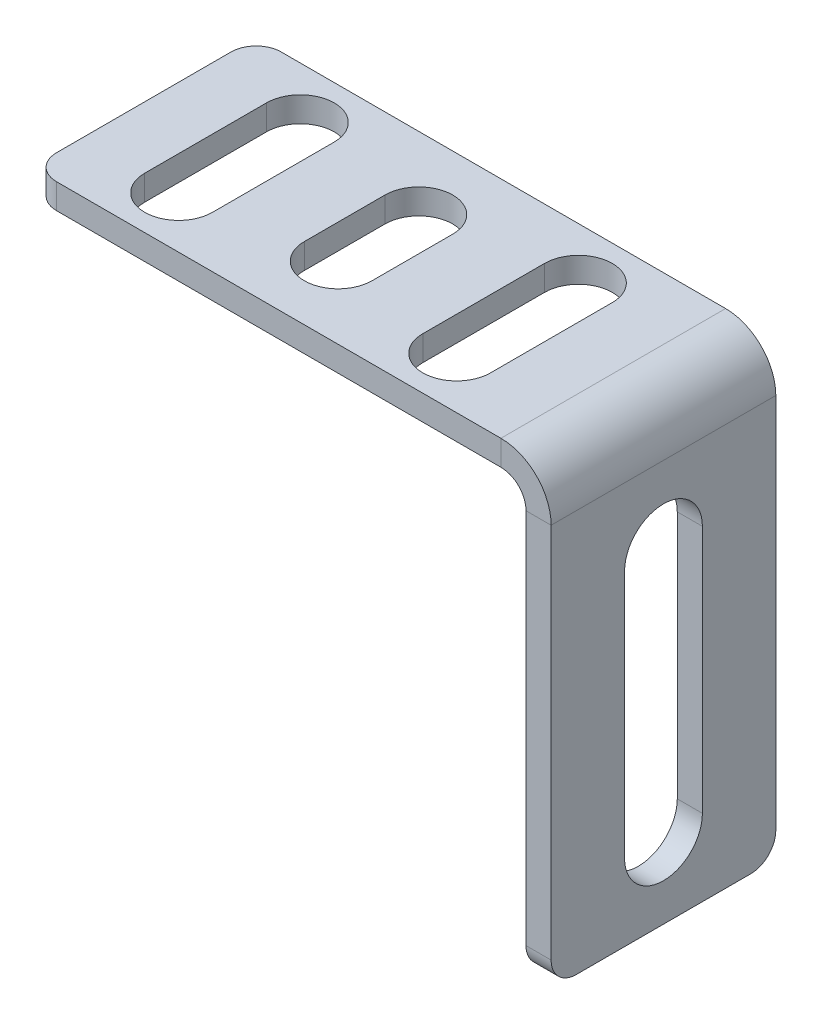
ISO-10303-21;
HEADER;
FILE_DESCRIPTION(('STEP AP214'),'2;1');
FILE_NAME('part.step','',(''),(''),'','','');
FILE_SCHEMA(('AUTOMOTIVE_DESIGN { 1 0 10303 214 1 1 1 1 }'));
ENDSEC;
DATA;
#1=APPLICATION_CONTEXT('core data for automotive mechanical design processes');
#2=APPLICATION_PROTOCOL_DEFINITION('international standard','automotive_design',2000,#1);
#3=PRODUCT_CONTEXT('',#1,'mechanical');
#4=PRODUCT('Part','Part','',(#3));
#5=PRODUCT_RELATED_PRODUCT_CATEGORY('part','',(#4));
#6=PRODUCT_DEFINITION_FORMATION('','',#4);
#7=PRODUCT_DEFINITION_CONTEXT('part definition',#1,'design');
#8=PRODUCT_DEFINITION('design','',#6,#7);
#9=PRODUCT_DEFINITION_SHAPE('','',#8);
#10=(LENGTH_UNIT() NAMED_UNIT(*) SI_UNIT(.MILLI.,.METRE.));
#11=(NAMED_UNIT(*) PLANE_ANGLE_UNIT() SI_UNIT($,.RADIAN.));
#12=(NAMED_UNIT(*) SI_UNIT($,.STERADIAN.) SOLID_ANGLE_UNIT());
#13=UNCERTAINTY_MEASURE_WITH_UNIT(LENGTH_MEASURE(1.E-05),#10,'distance_accuracy_value','');
#14=(GEOMETRIC_REPRESENTATION_CONTEXT(3) GLOBAL_UNCERTAINTY_ASSIGNED_CONTEXT((#13)) GLOBAL_UNIT_ASSIGNED_CONTEXT((#10,
#11,#12)) REPRESENTATION_CONTEXT('',''));
#15=CARTESIAN_POINT('',(0.,0.,0.));
#16=DIRECTION('',(0.,0.,1.));
#17=DIRECTION('',(1.,0.,0.));
#18=AXIS2_PLACEMENT_3D('',#15,#16,#17);
#19=CARTESIAN_POINT('',(-11.625,-36.001,4.10000000000001));
#20=DIRECTION('',(0.,1.,0.));
#21=DIRECTION('',(-1.,0.,0.));
#22=AXIS2_PLACEMENT_3D('',#19,#20,#21);
#23=CYLINDRICAL_SURFACE('',#22,2.7);
#24=DIRECTION('',(0.,1.,0.));
#25=VECTOR('',#24,1.);
#26=CARTESIAN_POINT('',(-8.925,-36.,4.10000000000001));
#27=LINE('',#26,#25);
#28=CARTESIAN_POINT('',(-8.925,-2.,4.10000000000001));
#29=VERTEX_POINT('',#28);
#30=CARTESIAN_POINT('',(-8.925,0.,4.10000000000001));
#31=VERTEX_POINT('',#30);
#32=EDGE_CURVE('E368',#29,#31,#27,.T.);
#33=ORIENTED_EDGE('',*,*,#32,.T.);
#34=CARTESIAN_POINT('',(-11.625,0.,4.10000000000001));
#35=DIRECTION('',(0.,1.,0.));
#36=DIRECTION('',(-1.,0.,0.));
#37=AXIS2_PLACEMENT_3D('',#34,#35,#36);
#38=CIRCLE('',#37,2.7);
#39=CARTESIAN_POINT('',(-14.325,0.,4.10000000000002));
#40=VERTEX_POINT('',#39);
#41=EDGE_CURVE('E232',#31,#40,#38,.T.);
#42=ORIENTED_EDGE('',*,*,#41,.T.);
#43=DIRECTION('',(0.,1.,0.));
#44=VECTOR('',#43,1.);
#45=CARTESIAN_POINT('',(-14.325,-36.,4.10000000000002));
#46=LINE('',#45,#44);
#47=CARTESIAN_POINT('',(-14.325,-2.,4.10000000000002));
#48=VERTEX_POINT('',#47);
#49=EDGE_CURVE('E819',#48,#40,#46,.T.);
#50=ORIENTED_EDGE('',*,*,#49,.F.);
#51=CARTESIAN_POINT('',(-11.625,-2.,4.10000000000001));
#52=DIRECTION('',(0.,-1.,0.));
#53=DIRECTION('',(1.,0.,0.));
#54=AXIS2_PLACEMENT_3D('',#51,#52,#53);
#55=CIRCLE('',#54,2.7);
#56=EDGE_CURVE('E240',#29,#48,#55,.F.);
#57=ORIENTED_EDGE('',*,*,#56,.F.);
#58=EDGE_LOOP('',(#33,#42,#50,#57));
#59=FACE_BOUND('',#58,.T.);
#60=ADVANCED_FACE('F16',(#59),#23,.F.);
#61=CARTESIAN_POINT('',(-33.775,-36.001,4.10000000000001));
#62=DIRECTION('',(0.,1.,0.));
#63=DIRECTION('',(-1.,0.,0.));
#64=AXIS2_PLACEMENT_3D('',#61,#62,#63);
#65=CYLINDRICAL_SURFACE('',#64,2.7);
#66=DIRECTION('',(0.,1.,0.));
#67=VECTOR('',#66,1.);
#68=CARTESIAN_POINT('',(-31.075,-36.,4.10000000000001));
#69=LINE('',#68,#67);
#70=CARTESIAN_POINT('',(-31.075,-2.00000000000001,4.10000000000001));
#71=VERTEX_POINT('',#70);
#72=CARTESIAN_POINT('',(-31.075,0.,4.10000000000001));
#73=VERTEX_POINT('',#72);
#74=EDGE_CURVE('E210',#71,#73,#69,.T.);
#75=ORIENTED_EDGE('',*,*,#74,.T.);
#76=CARTESIAN_POINT('',(-33.775,0.,4.10000000000001));
#77=DIRECTION('',(0.,1.,0.));
#78=DIRECTION('',(-1.,0.,0.));
#79=AXIS2_PLACEMENT_3D('',#76,#77,#78);
#80=CIRCLE('',#79,2.7);
#81=CARTESIAN_POINT('',(-36.475,0.,4.10000000000001));
#82=VERTEX_POINT('',#81);
#83=EDGE_CURVE('E219',#73,#82,#80,.T.);
#84=ORIENTED_EDGE('',*,*,#83,.T.);
#85=DIRECTION('',(0.,1.,0.));
#86=VECTOR('',#85,1.);
#87=CARTESIAN_POINT('',(-36.475,-36.,4.10000000000001));
#88=LINE('',#87,#86);
#89=CARTESIAN_POINT('',(-36.475,-2.00000000000001,4.10000000000001));
#90=VERTEX_POINT('',#89);
#91=EDGE_CURVE('E199',#90,#82,#88,.T.);
#92=ORIENTED_EDGE('',*,*,#91,.F.);
#93=CARTESIAN_POINT('',(-33.775,-2.00000000000001,4.10000000000001));
#94=DIRECTION('',(0.,-1.,0.));
#95=DIRECTION('',(1.,0.,0.));
#96=AXIS2_PLACEMENT_3D('',#93,#94,#95);
#97=CIRCLE('',#96,2.7);
#98=EDGE_CURVE('E227',#71,#90,#97,.F.);
#99=ORIENTED_EDGE('',*,*,#98,.F.);
#100=EDGE_LOOP('',(#75,#84,#92,#99));
#101=FACE_BOUND('',#100,.T.);
#102=ADVANCED_FACE('F225',(#101),#65,.F.);
#103=CARTESIAN_POINT('',(-22.7,-36.001,5.73561068648096));
#104=DIRECTION('',(0.,1.,0.));
#105=DIRECTION('',(-1.,0.,0.));
#106=AXIS2_PLACEMENT_3D('',#103,#104,#105);
#107=CYLINDRICAL_SURFACE('',#106,2.7);
#108=CARTESIAN_POINT('',(-22.7,-2.,5.73561068648096));
#109=DIRECTION('',(0.,-1.,0.));
#110=DIRECTION('',(1.,0.,0.));
#111=AXIS2_PLACEMENT_3D('',#108,#109,#110);
#112=CIRCLE('',#111,2.7);
#113=CARTESIAN_POINT('',(-25.4,-2.,5.73561068648096));
#114=VERTEX_POINT('',#113);
#115=CARTESIAN_POINT('',(-20.,-2.,5.73561068648096));
#116=VERTEX_POINT('',#115);
#117=EDGE_CURVE('E371',#114,#116,#112,.T.);
#118=ORIENTED_EDGE('',*,*,#117,.T.);
#119=DIRECTION('',(0.,1.,0.));
#120=VECTOR('',#119,1.);
#121=CARTESIAN_POINT('',(-20.,-36.001,5.73561068648096));
#122=LINE('',#121,#120);
#123=CARTESIAN_POINT('',(-20.,0.,5.73561068648096));
#124=VERTEX_POINT('',#123);
#125=EDGE_CURVE('E10',#116,#124,#122,.T.);
#126=ORIENTED_EDGE('',*,*,#125,.T.);
#127=CARTESIAN_POINT('',(-22.7,0.,5.73561068648096));
#128=DIRECTION('',(0.,-1.,0.));
#129=DIRECTION('',(-1.,0.,0.));
#130=AXIS2_PLACEMENT_3D('',#127,#128,#129);
#131=CIRCLE('',#130,2.7);
#132=CARTESIAN_POINT('',(-25.4,0.,5.73561068648096));
#133=VERTEX_POINT('',#132);
#134=EDGE_CURVE('E367',#133,#124,#131,.T.);
#135=ORIENTED_EDGE('',*,*,#134,.F.);
#136=DIRECTION('',(0.,1.,0.));
#137=VECTOR('',#136,1.);
#138=CARTESIAN_POINT('',(-25.4,-36.001,5.73561068648096));
#139=LINE('',#138,#137);
#140=EDGE_CURVE('E24',#114,#133,#139,.T.);
#141=ORIENTED_EDGE('',*,*,#140,.F.);
#142=EDGE_LOOP('',(#118,#126,#135,#141));
#143=FACE_BOUND('',#142,.T.);
#144=ADVANCED_FACE('F370',(#143),#107,.F.);
#145=CARTESIAN_POINT('',(-2.,0.,0.));
#146=DIRECTION('',(0.,0.,1.));
#147=DIRECTION('',(0.,1.,0.));
#148=AXIS2_PLACEMENT_3D('',#145,#146,#147);
#149=PLANE('',#148);
#150=DIRECTION('',(0.,-1.,0.));
#151=VECTOR('',#150,1.);
#152=CARTESIAN_POINT('',(0.,0.,0.));
#153=LINE('',#152,#151);
#154=CARTESIAN_POINT('',(0.,-34.,0.));
#155=VERTEX_POINT('',#154);
#156=CARTESIAN_POINT('',(0.,-4.,0.));
#157=VERTEX_POINT('',#156);
#158=EDGE_CURVE('E298',#155,#157,#153,.F.);
#159=ORIENTED_EDGE('',*,*,#158,.F.);
#160=DIRECTION('',(1.,0.,0.));
#161=VECTOR('',#160,1.);
#162=CARTESIAN_POINT('',(-2.,-34.,0.));
#163=LINE('',#162,#161);
#164=CARTESIAN_POINT('',(-2.,-34.,0.));
#165=VERTEX_POINT('',#164);
#166=EDGE_CURVE('E310',#155,#165,#163,.F.);
#167=ORIENTED_EDGE('',*,*,#166,.T.);
#168=DIRECTION('',(0.,1.,0.));
#169=VECTOR('',#168,1.);
#170=CARTESIAN_POINT('',(-2.,0.,0.));
#171=LINE('',#170,#169);
#172=CARTESIAN_POINT('',(-2.,-4.,0.));
#173=VERTEX_POINT('',#172);
#174=EDGE_CURVE('E252',#165,#173,#171,.T.);
#175=ORIENTED_EDGE('',*,*,#174,.T.);
#176=DIRECTION('',(-1.,0.,0.));
#177=VECTOR('',#176,1.);
#178=CARTESIAN_POINT('',(-2.,-4.,0.));
#179=LINE('',#178,#177);
#180=EDGE_CURVE('E307',#157,#173,#179,.T.);
#181=ORIENTED_EDGE('',*,*,#180,.F.);
#182=EDGE_LOOP('',(#159,#167,#175,#181));
#183=FACE_BOUND('',#182,.T.);
#184=ADVANCED_FACE('F498',(#183),#149,.F.);
#185=CARTESIAN_POINT('',(-2.,-36.,72.7631023548614));
#186=DIRECTION('',(0.,1.,0.));
#187=DIRECTION('',(0.,0.,-1.));
#188=AXIS2_PLACEMENT_3D('',#185,#186,#187);
#189=PLANE('',#188);
#190=DIRECTION('',(0.,0.,-1.));
#191=VECTOR('',#190,1.);
#192=CARTESIAN_POINT('',(-2.,-36.,72.7631023548614));
#193=LINE('',#192,#191);
#194=CARTESIAN_POINT('',(-2.,-36.,15.9));
#195=VERTEX_POINT('',#194);
#196=CARTESIAN_POINT('',(-2.,-36.,2.));
#197=VERTEX_POINT('',#196);
#198=EDGE_CURVE('E255',#195,#197,#193,.T.);
#199=ORIENTED_EDGE('',*,*,#198,.T.);
#200=DIRECTION('',(1.,0.,0.));
#201=VECTOR('',#200,1.);
#202=CARTESIAN_POINT('',(-2.,-36.,2.));
#203=LINE('',#202,#201);
#204=CARTESIAN_POINT('',(0.,-36.,2.));
#205=VERTEX_POINT('',#204);
#206=EDGE_CURVE('E321',#197,#205,#203,.T.);
#207=ORIENTED_EDGE('',*,*,#206,.T.);
#208=DIRECTION('',(0.,0.,1.));
#209=VECTOR('',#208,1.);
#210=CARTESIAN_POINT('',(0.,-36.,72.7631023548614));
#211=LINE('',#210,#209);
#212=CARTESIAN_POINT('',(0.,-36.,15.9));
#213=VERTEX_POINT('',#212);
#214=EDGE_CURVE('E292',#213,#205,#211,.F.);
#215=ORIENTED_EDGE('',*,*,#214,.F.);
#216=DIRECTION('',(1.,0.,0.));
#217=VECTOR('',#216,1.);
#218=CARTESIAN_POINT('',(-2.,-36.,15.9));
#219=LINE('',#218,#217);
#220=EDGE_CURVE('E318',#213,#195,#219,.F.);
#221=ORIENTED_EDGE('',*,*,#220,.T.);
#222=EDGE_LOOP('',(#199,#207,#215,#221));
#223=FACE_BOUND('',#222,.T.);
#224=ADVANCED_FACE('F494',(#223),#189,.F.);
#225=CARTESIAN_POINT('',(-2.,0.,17.9));
#226=DIRECTION('',(0.,0.,-1.));
#227=DIRECTION('',(0.,-1.,0.));
#228=AXIS2_PLACEMENT_3D('',#225,#226,#227);
#229=PLANE('',#228);
#230=DIRECTION('',(0.,-1.,0.));
#231=VECTOR('',#230,1.);
#232=CARTESIAN_POINT('',(-2.,0.,17.9));
#233=LINE('',#232,#231);
#234=CARTESIAN_POINT('',(-2.,-4.,17.9));
#235=VERTEX_POINT('',#234);
#236=CARTESIAN_POINT('',(-2.,-34.,17.9));
#237=VERTEX_POINT('',#236);
#238=EDGE_CURVE('E249',#235,#237,#233,.T.);
#239=ORIENTED_EDGE('',*,*,#238,.T.);
#240=DIRECTION('',(1.,0.,0.));
#241=VECTOR('',#240,1.);
#242=CARTESIAN_POINT('',(-2.,-34.,17.9));
#243=LINE('',#242,#241);
#244=CARTESIAN_POINT('',(0.,-34.,17.9));
#245=VERTEX_POINT('',#244);
#246=EDGE_CURVE('E327',#237,#245,#243,.T.);
#247=ORIENTED_EDGE('',*,*,#246,.T.);
#248=DIRECTION('',(0.,-1.,0.));
#249=VECTOR('',#248,1.);
#250=CARTESIAN_POINT('',(0.,0.,17.9));
#251=LINE('',#250,#249);
#252=CARTESIAN_POINT('',(0.,-4.,17.9));
#253=VERTEX_POINT('',#252);
#254=EDGE_CURVE('E295',#253,#245,#251,.T.);
#255=ORIENTED_EDGE('',*,*,#254,.F.);
#256=DIRECTION('',(-1.,0.,0.));
#257=VECTOR('',#256,1.);
#258=CARTESIAN_POINT('',(-2.,-4.,17.9));
#259=LINE('',#258,#257);
#260=EDGE_CURVE('E305',#253,#235,#259,.T.);
#261=ORIENTED_EDGE('',*,*,#260,.T.);
#262=EDGE_LOOP('',(#239,#247,#255,#261));
#263=FACE_BOUND('',#262,.T.);
#264=ADVANCED_FACE('F490',(#263),#229,.F.);
#265=CARTESIAN_POINT('',(-4.,-4.,17.9));
#266=DIRECTION('',(0.,0.,1.));
#267=DIRECTION('',(1.,0.,0.));
#268=AXIS2_PLACEMENT_3D('',#265,#266,#267);
#269=PLANE('',#268);
#270=ORIENTED_EDGE('',*,*,#260,.F.);
#271=CARTESIAN_POINT('',(-4.,-4.,17.9));
#272=DIRECTION('',(0.,0.,1.));
#273=DIRECTION('',(1.,0.,0.));
#274=AXIS2_PLACEMENT_3D('',#271,#272,#273);
#275=CIRCLE('',#274,4.);
#276=CARTESIAN_POINT('',(-4.,0.,17.9));
#277=VERTEX_POINT('',#276);
#278=EDGE_CURVE('E230',#253,#277,#275,.T.);
#279=ORIENTED_EDGE('',*,*,#278,.T.);
#280=DIRECTION('',(0.,-1.,0.));
#281=VECTOR('',#280,1.);
#282=CARTESIAN_POINT('',(-4.,-2.,17.9));
#283=LINE('',#282,#281);
#284=CARTESIAN_POINT('',(-4.,-2.,17.9));
#285=VERTEX_POINT('',#284);
#286=EDGE_CURVE('E302',#277,#285,#283,.T.);
#287=ORIENTED_EDGE('',*,*,#286,.T.);
#288=CARTESIAN_POINT('',(-4.,-4.,17.9));
#289=DIRECTION('',(0.,0.,-1.));
#290=DIRECTION('',(-1.,0.,0.));
#291=AXIS2_PLACEMENT_3D('',#288,#289,#290);
#292=CIRCLE('',#291,2.);
#293=EDGE_CURVE('E253',#235,#285,#292,.F.);
#294=ORIENTED_EDGE('',*,*,#293,.F.);
#295=EDGE_LOOP('',(#270,#279,#287,#294));
#296=FACE_BOUND('',#295,.T.);
#297=ADVANCED_FACE('F486',(#296),#269,.T.);
#298=CARTESIAN_POINT('',(0.,-2.,17.9));
#299=DIRECTION('',(0.,0.,-1.));
#300=DIRECTION('',(1.,0.,0.));
#301=AXIS2_PLACEMENT_3D('',#298,#299,#300);
#302=PLANE('',#301);
#303=DIRECTION('',(1.,0.,0.));
#304=VECTOR('',#303,1.);
#305=CARTESIAN_POINT('',(0.,0.,17.9));
#306=LINE('',#305,#304);
#307=CARTESIAN_POINT('',(-39.4,0.,17.9));
#308=VERTEX_POINT('',#307);
#309=EDGE_CURVE('E290',#308,#277,#306,.T.);
#310=ORIENTED_EDGE('',*,*,#309,.F.);
#311=DIRECTION('',(0.,-1.,0.));
#312=VECTOR('',#311,1.);
#313=CARTESIAN_POINT('',(-39.4,-2.,17.9));
#314=LINE('',#313,#312);
#315=CARTESIAN_POINT('',(-39.4,-2.,17.9));
#316=VERTEX_POINT('',#315);
#317=EDGE_CURVE('E329',#308,#316,#314,.T.);
#318=ORIENTED_EDGE('',*,*,#317,.T.);
#319=DIRECTION('',(1.,0.,0.));
#320=VECTOR('',#319,1.);
#321=CARTESIAN_POINT('',(0.,-2.,17.9));
#322=LINE('',#321,#320);
#323=EDGE_CURVE('E258',#316,#285,#322,.T.);
#324=ORIENTED_EDGE('',*,*,#323,.T.);
#325=ORIENTED_EDGE('',*,*,#286,.F.);
#326=EDGE_LOOP('',(#310,#318,#324,#325));
#327=FACE_BOUND('',#326,.T.);
#328=ADVANCED_FACE('F482',(#327),#302,.F.);
#329=CARTESIAN_POINT('',(-41.4,-2.00000000000001,72.7631023548614));
#330=DIRECTION('',(-1.,0.,0.));
#331=DIRECTION('',(0.,0.,-1.));
#332=AXIS2_PLACEMENT_3D('',#329,#330,#331);
#333=PLANE('',#332);
#334=DIRECTION('',(0.,0.,-1.));
#335=VECTOR('',#334,1.);
#336=CARTESIAN_POINT('',(-41.4,-2.00000000000001,72.7631023548614));
#337=LINE('',#336,#335);
#338=CARTESIAN_POINT('',(-41.4,-2.00000000000001,15.9));
#339=VERTEX_POINT('',#338);
#340=CARTESIAN_POINT('',(-41.4,-2.00000000000001,2.));
#341=VERTEX_POINT('',#340);
#342=EDGE_CURVE('E260',#339,#341,#337,.T.);
#343=ORIENTED_EDGE('',*,*,#342,.F.);
#344=DIRECTION('',(0.,1.,0.));
#345=VECTOR('',#344,1.);
#346=CARTESIAN_POINT('',(-41.4,-2.00000000000001,15.9));
#347=LINE('',#346,#345);
#348=CARTESIAN_POINT('',(-41.4,0.,15.9));
#349=VERTEX_POINT('',#348);
#350=EDGE_CURVE('E339',#339,#349,#347,.T.);
#351=ORIENTED_EDGE('',*,*,#350,.T.);
#352=DIRECTION('',(0.,0.,1.));
#353=VECTOR('',#352,1.);
#354=CARTESIAN_POINT('',(-41.4,0.,72.7631023548614));
#355=LINE('',#354,#353);
#356=CARTESIAN_POINT('',(-41.4,0.,2.));
#357=VERTEX_POINT('',#356);
#358=EDGE_CURVE('E287',#349,#357,#355,.F.);
#359=ORIENTED_EDGE('',*,*,#358,.T.);
#360=DIRECTION('',(0.,1.,0.));
#361=VECTOR('',#360,1.);
#362=CARTESIAN_POINT('',(-41.4,-2.00000000000001,2.));
#363=LINE('',#362,#361);
#364=EDGE_CURVE('E336',#357,#341,#363,.F.);
#365=ORIENTED_EDGE('',*,*,#364,.T.);
#366=EDGE_LOOP('',(#343,#351,#359,#365));
#367=FACE_BOUND('',#366,.T.);
#368=ADVANCED_FACE('F478',(#367),#333,.T.);
#369=CARTESIAN_POINT('',(0.,-2.,0.));
#370=DIRECTION('',(0.,0.,1.));
#371=DIRECTION('',(-1.,0.,0.));
#372=AXIS2_PLACEMENT_3D('',#369,#370,#371);
#373=PLANE('',#372);
#374=DIRECTION('',(-1.,0.,0.));
#375=VECTOR('',#374,1.);
#376=CARTESIAN_POINT('',(0.,-2.,0.));
#377=LINE('',#376,#375);
#378=CARTESIAN_POINT('',(-4.,-2.,0.));
#379=VERTEX_POINT('',#378);
#380=CARTESIAN_POINT('',(-39.4,-2.,0.));
#381=VERTEX_POINT('',#380);
#382=EDGE_CURVE('E263',#379,#381,#377,.T.);
#383=ORIENTED_EDGE('',*,*,#382,.T.);
#384=DIRECTION('',(0.,-1.,0.));
#385=VECTOR('',#384,1.);
#386=CARTESIAN_POINT('',(-39.4,-2.,0.));
#387=LINE('',#386,#385);
#388=CARTESIAN_POINT('',(-39.4,0.,0.));
#389=VERTEX_POINT('',#388);
#390=EDGE_CURVE('E345',#381,#389,#387,.F.);
#391=ORIENTED_EDGE('',*,*,#390,.T.);
#392=DIRECTION('',(1.,0.,0.));
#393=VECTOR('',#392,1.);
#394=CARTESIAN_POINT('',(0.,0.,0.));
#395=LINE('',#394,#393);
#396=CARTESIAN_POINT('',(-4.,0.,0.));
#397=VERTEX_POINT('',#396);
#398=EDGE_CURVE('E284',#397,#389,#395,.F.);
#399=ORIENTED_EDGE('',*,*,#398,.F.);
#400=DIRECTION('',(0.,-1.,0.));
#401=VECTOR('',#400,1.);
#402=CARTESIAN_POINT('',(-4.,-2.,0.));
#403=LINE('',#402,#401);
#404=EDGE_CURVE('E272',#397,#379,#403,.T.);
#405=ORIENTED_EDGE('',*,*,#404,.T.);
#406=EDGE_LOOP('',(#383,#391,#399,#405));
#407=FACE_BOUND('',#406,.T.);
#408=ADVANCED_FACE('F475',(#407),#373,.F.);
#409=CARTESIAN_POINT('',(-4.,-4.,0.));
#410=DIRECTION('',(0.,0.,-1.));
#411=DIRECTION('',(-1.,0.,0.));
#412=AXIS2_PLACEMENT_3D('',#409,#410,#411);
#413=PLANE('',#412);
#414=CARTESIAN_POINT('',(-4.,-4.,0.));
#415=DIRECTION('',(0.,0.,1.));
#416=DIRECTION('',(1.,0.,0.));
#417=AXIS2_PLACEMENT_3D('',#414,#415,#416);
#418=CIRCLE('',#417,4.);
#419=EDGE_CURVE('E226',#397,#157,#418,.F.);
#420=ORIENTED_EDGE('',*,*,#419,.T.);
#421=ORIENTED_EDGE('',*,*,#180,.T.);
#422=CARTESIAN_POINT('',(-4.,-4.,0.));
#423=DIRECTION('',(0.,0.,1.));
#424=DIRECTION('',(1.,0.,0.));
#425=AXIS2_PLACEMENT_3D('',#422,#423,#424);
#426=CIRCLE('',#425,2.);
#427=EDGE_CURVE('E273',#379,#173,#426,.F.);
#428=ORIENTED_EDGE('',*,*,#427,.F.);
#429=ORIENTED_EDGE('',*,*,#404,.F.);
#430=EDGE_LOOP('',(#420,#421,#428,#429));
#431=FACE_BOUND('',#430,.T.);
#432=ADVANCED_FACE('F461',(#431),#413,.T.);
#433=CARTESIAN_POINT('',(0.,-2.,72.7631023548614));
#434=DIRECTION('',(0.,-1.,0.));
#435=DIRECTION('',(1.,0.,0.));
#436=AXIS2_PLACEMENT_3D('',#433,#434,#435);
#437=PLANE('',#436);
#438=DIRECTION('',(0.,0.,1.));
#439=VECTOR('',#438,1.);
#440=CARTESIAN_POINT('',(-31.075,-2.,72.7631023548614));
#441=LINE('',#440,#439);
#442=CARTESIAN_POINT('',(-31.075,-2.00000000000001,13.8));
#443=VERTEX_POINT('',#442);
#444=EDGE_CURVE('E815',#71,#443,#441,.T.);
#445=ORIENTED_EDGE('',*,*,#444,.F.);
#446=ORIENTED_EDGE('',*,*,#98,.T.);
#447=DIRECTION('',(0.,0.,-1.));
#448=VECTOR('',#447,1.);
#449=CARTESIAN_POINT('',(-36.475,-2.,72.7631023548614));
#450=LINE('',#449,#448);
#451=CARTESIAN_POINT('',(-36.475,-2.00000000000001,13.8));
#452=VERTEX_POINT('',#451);
#453=EDGE_CURVE('E205',#452,#90,#450,.T.);
#454=ORIENTED_EDGE('',*,*,#453,.F.);
#455=CARTESIAN_POINT('',(-33.775,-2.00000000000001,13.8));
#456=DIRECTION('',(0.,-1.,0.));
#457=DIRECTION('',(1.,0.,0.));
#458=AXIS2_PLACEMENT_3D('',#455,#456,#457);
#459=CIRCLE('',#458,2.7);
#460=EDGE_CURVE('E384',#443,#452,#459,.T.);
#461=ORIENTED_EDGE('',*,*,#460,.F.);
#462=EDGE_LOOP('',(#445,#446,#454,#461));
#463=FACE_BOUND('',#462,.T.);
#464=DIRECTION('',(0.,0.,1.));
#465=VECTOR('',#464,1.);
#466=CARTESIAN_POINT('',(-20.,-2.,72.7631023548614));
#467=LINE('',#466,#465);
#468=CARTESIAN_POINT('',(-20.,-2.,12.164389313519));
#469=VERTEX_POINT('',#468);
#470=EDGE_CURVE('E372',#116,#469,#467,.T.);
#471=ORIENTED_EDGE('',*,*,#470,.F.);
#472=ORIENTED_EDGE('',*,*,#117,.F.);
#473=DIRECTION('',(0.,0.,-1.));
#474=VECTOR('',#473,1.);
#475=CARTESIAN_POINT('',(-25.4,-2.,72.7631023548614));
#476=LINE('',#475,#474);
#477=CARTESIAN_POINT('',(-25.4,-2.,12.164389313519));
#478=VERTEX_POINT('',#477);
#479=EDGE_CURVE('E38',#478,#114,#476,.T.);
#480=ORIENTED_EDGE('',*,*,#479,.F.);
#481=CARTESIAN_POINT('',(-22.7,-2.,12.164389313519));
#482=DIRECTION('',(0.,-1.,0.));
#483=DIRECTION('',(1.,0.,0.));
#484=AXIS2_PLACEMENT_3D('',#481,#482,#483);
#485=CIRCLE('',#484,2.7);
#486=EDGE_CURVE('E246',#478,#469,#485,.F.);
#487=ORIENTED_EDGE('',*,*,#486,.T.);
#488=EDGE_LOOP('',(#471,#472,#480,#487));
#489=FACE_BOUND('',#488,.T.);
#490=DIRECTION('',(0.,0.,1.));
#491=VECTOR('',#490,1.);
#492=CARTESIAN_POINT('',(-8.92499999999998,-2.,72.7631023548614));
#493=LINE('',#492,#491);
#494=CARTESIAN_POINT('',(-8.925,-2.,13.8));
#495=VERTEX_POINT('',#494);
#496=EDGE_CURVE('E796',#29,#495,#493,.T.);
#497=ORIENTED_EDGE('',*,*,#496,.F.);
#498=ORIENTED_EDGE('',*,*,#56,.T.);
#499=DIRECTION('',(0.,0.,-1.));
#500=VECTOR('',#499,1.);
#501=CARTESIAN_POINT('',(-14.325,-2.,72.7631023548614));
#502=LINE('',#501,#500);
#503=CARTESIAN_POINT('',(-14.325,-2.,13.8));
#504=VERTEX_POINT('',#503);
#505=EDGE_CURVE('E798',#504,#48,#502,.T.);
#506=ORIENTED_EDGE('',*,*,#505,.F.);
#507=CARTESIAN_POINT('',(-11.625,-2.,13.8));
#508=DIRECTION('',(0.,-1.,0.));
#509=DIRECTION('',(1.,0.,0.));
#510=AXIS2_PLACEMENT_3D('',#507,#508,#509);
#511=CIRCLE('',#510,2.7);
#512=EDGE_CURVE('E378',#495,#504,#511,.T.);
#513=ORIENTED_EDGE('',*,*,#512,.F.);
#514=EDGE_LOOP('',(#497,#498,#506,#513));
#515=FACE_BOUND('',#514,.T.);
#516=ORIENTED_EDGE('',*,*,#323,.F.);
#517=CARTESIAN_POINT('',(-39.4,-2.,15.9));
#518=DIRECTION('',(0.,-1.,0.));
#519=DIRECTION('',(1.,0.,0.));
#520=AXIS2_PLACEMENT_3D('',#517,#518,#519);
#521=CIRCLE('',#520,2.);
#522=EDGE_CURVE('E334',#316,#339,#521,.T.);
#523=ORIENTED_EDGE('',*,*,#522,.T.);
#524=ORIENTED_EDGE('',*,*,#342,.T.);
#525=CARTESIAN_POINT('',(-39.4,-2.,2.));
#526=DIRECTION('',(0.,-1.,0.));
#527=DIRECTION('',(1.,0.,0.));
#528=AXIS2_PLACEMENT_3D('',#525,#526,#527);
#529=CIRCLE('',#528,2.);
#530=EDGE_CURVE('E332',#341,#381,#529,.T.);
#531=ORIENTED_EDGE('',*,*,#530,.T.);
#532=ORIENTED_EDGE('',*,*,#382,.F.);
#533=DIRECTION('',(0.,0.,-1.));
#534=VECTOR('',#533,1.);
#535=CARTESIAN_POINT('',(-4.,-2.,17.9));
#536=LINE('',#535,#534);
#537=EDGE_CURVE('E269',#379,#285,#536,.F.);
#538=ORIENTED_EDGE('',*,*,#537,.T.);
#539=EDGE_LOOP('',(#516,#523,#524,#531,#532,#538));
#540=FACE_BOUND('',#539,.T.);
#541=ADVANCED_FACE('F458',(#463,#489,#515,#540),#437,.T.);
#542=CARTESIAN_POINT('',(-2.,0.,72.7631023548614));
#543=DIRECTION('',(-1.,0.,0.));
#544=DIRECTION('',(0.,-1.,0.));
#545=AXIS2_PLACEMENT_3D('',#542,#543,#544);
#546=PLANE('',#545);
#547=CARTESIAN_POINT('',(-2.,-29.9,8.95000000000001));
#548=DIRECTION('',(-1.,0.,0.));
#549=DIRECTION('',(0.,-1.,0.));
#550=AXIS2_PLACEMENT_3D('',#547,#548,#549);
#551=CIRCLE('',#550,3.1);
#552=CARTESIAN_POINT('',(-2.,-29.9,5.85000000000001));
#553=VERTEX_POINT('',#552);
#554=CARTESIAN_POINT('',(-2.,-29.9,12.05));
#555=VERTEX_POINT('',#554);
#556=EDGE_CURVE('E390',#553,#555,#551,.T.);
#557=ORIENTED_EDGE('',*,*,#556,.F.);
#558=DIRECTION('',(0.,-1.,0.));
#559=VECTOR('',#558,1.);
#560=CARTESIAN_POINT('',(-2.,-29.9,5.85000000000001));
#561=LINE('',#560,#559);
#562=CARTESIAN_POINT('',(-2.,-10.1,5.85000000000001));
#563=VERTEX_POINT('',#562);
#564=EDGE_CURVE('E398',#563,#553,#561,.T.);
#565=ORIENTED_EDGE('',*,*,#564,.F.);
#566=CARTESIAN_POINT('',(-2.,-10.1,8.95000000000001));
#567=DIRECTION('',(-1.,0.,0.));
#568=DIRECTION('',(0.,-1.,0.));
#569=AXIS2_PLACEMENT_3D('',#566,#567,#568);
#570=CIRCLE('',#569,3.1);
#571=CARTESIAN_POINT('',(-2.,-10.1,12.05));
#572=VERTEX_POINT('',#571);
#573=EDGE_CURVE('E395',#572,#563,#570,.T.);
#574=ORIENTED_EDGE('',*,*,#573,.F.);
#575=DIRECTION('',(0.,1.,0.));
#576=VECTOR('',#575,1.);
#577=CARTESIAN_POINT('',(-2.,-29.9,12.05));
#578=LINE('',#577,#576);
#579=EDGE_CURVE('E392',#555,#572,#578,.T.);
#580=ORIENTED_EDGE('',*,*,#579,.F.);
#581=EDGE_LOOP('',(#557,#565,#574,#580));
#582=FACE_BOUND('',#581,.T.);
#583=ORIENTED_EDGE('',*,*,#174,.F.);
#584=CARTESIAN_POINT('',(-2.,-34.,2.));
#585=DIRECTION('',(-1.,0.,0.));
#586=DIRECTION('',(0.,-1.,0.));
#587=AXIS2_PLACEMENT_3D('',#584,#585,#586);
#588=CIRCLE('',#587,2.);
#589=EDGE_CURVE('E316',#165,#197,#588,.T.);
#590=ORIENTED_EDGE('',*,*,#589,.T.);
#591=ORIENTED_EDGE('',*,*,#198,.F.);
#592=CARTESIAN_POINT('',(-2.,-34.,15.9));
#593=DIRECTION('',(-1.,0.,0.));
#594=DIRECTION('',(0.,-1.,0.));
#595=AXIS2_PLACEMENT_3D('',#592,#593,#594);
#596=CIRCLE('',#595,2.);
#597=EDGE_CURVE('E314',#195,#237,#596,.T.);
#598=ORIENTED_EDGE('',*,*,#597,.T.);
#599=ORIENTED_EDGE('',*,*,#238,.F.);
#600=DIRECTION('',(0.,0.,-1.));
#601=VECTOR('',#600,1.);
#602=CARTESIAN_POINT('',(-2.,-4.,0.));
#603=LINE('',#602,#601);
#604=EDGE_CURVE('E266',#235,#173,#603,.T.);
#605=ORIENTED_EDGE('',*,*,#604,.T.);
#606=EDGE_LOOP('',(#583,#590,#591,#598,#599,#605));
#607=FACE_BOUND('',#606,.T.);
#608=ADVANCED_FACE('F419',(#582,#607),#546,.T.);
#609=CARTESIAN_POINT('',(-4.,-4.,72.7631023548614));
#610=DIRECTION('',(0.,0.,1.));
#611=DIRECTION('',(1.,0.,0.));
#612=AXIS2_PLACEMENT_3D('',#609,#610,#611);
#613=CYLINDRICAL_SURFACE('',#612,2.);
#614=ORIENTED_EDGE('',*,*,#293,.T.);
#615=ORIENTED_EDGE('',*,*,#537,.F.);
#616=ORIENTED_EDGE('',*,*,#427,.T.);
#617=ORIENTED_EDGE('',*,*,#604,.F.);
#618=EDGE_LOOP('',(#614,#615,#616,#617));
#619=FACE_BOUND('',#618,.T.);
#620=ADVANCED_FACE('F457',(#619),#613,.F.);
#621=CARTESIAN_POINT('',(0.,0.,72.7631023548614));
#622=DIRECTION('',(0.,-1.,0.));
#623=DIRECTION('',(1.,0.,0.));
#624=AXIS2_PLACEMENT_3D('',#621,#622,#623);
#625=PLANE('',#624);
#626=ORIENTED_EDGE('',*,*,#83,.F.);
#627=DIRECTION('',(0.,0.,-1.));
#628=VECTOR('',#627,1.);
#629=CARTESIAN_POINT('',(-31.075,0.,4.10000000000001));
#630=LINE('',#629,#628);
#631=CARTESIAN_POINT('',(-31.075,0.,13.8));
#632=VERTEX_POINT('',#631);
#633=EDGE_CURVE('E211',#632,#73,#630,.T.);
#634=ORIENTED_EDGE('',*,*,#633,.F.);
#635=CARTESIAN_POINT('',(-33.775,0.,13.8));
#636=DIRECTION('',(0.,-1.,0.));
#637=DIRECTION('',(-1.,0.,0.));
#638=AXIS2_PLACEMENT_3D('',#635,#636,#637);
#639=CIRCLE('',#638,2.7);
#640=CARTESIAN_POINT('',(-36.475,0.,13.8));
#641=VERTEX_POINT('',#640);
#642=EDGE_CURVE('E221',#632,#641,#639,.T.);
#643=ORIENTED_EDGE('',*,*,#642,.T.);
#644=DIRECTION('',(0.,0.,1.));
#645=VECTOR('',#644,1.);
#646=CARTESIAN_POINT('',(-36.475,0.,4.10000000000001));
#647=LINE('',#646,#645);
#648=EDGE_CURVE('E202',#82,#641,#647,.T.);
#649=ORIENTED_EDGE('',*,*,#648,.F.);
#650=EDGE_LOOP('',(#626,#634,#643,#649));
#651=FACE_BOUND('',#650,.T.);
#652=ORIENTED_EDGE('',*,*,#41,.F.);
#653=DIRECTION('',(0.,0.,-1.));
#654=VECTOR('',#653,1.);
#655=CARTESIAN_POINT('',(-8.925,0.,4.10000000000001));
#656=LINE('',#655,#654);
#657=CARTESIAN_POINT('',(-8.925,0.,13.8));
#658=VERTEX_POINT('',#657);
#659=EDGE_CURVE('E821',#658,#31,#656,.T.);
#660=ORIENTED_EDGE('',*,*,#659,.F.);
#661=CARTESIAN_POINT('',(-11.625,0.,13.8));
#662=DIRECTION('',(0.,-1.,0.));
#663=DIRECTION('',(-1.,0.,0.));
#664=AXIS2_PLACEMENT_3D('',#661,#662,#663);
#665=CIRCLE('',#664,2.7);
#666=CARTESIAN_POINT('',(-14.325,0.,13.8));
#667=VERTEX_POINT('',#666);
#668=EDGE_CURVE('E374',#658,#667,#665,.T.);
#669=ORIENTED_EDGE('',*,*,#668,.T.);
#670=DIRECTION('',(0.,0.,1.));
#671=VECTOR('',#670,1.);
#672=CARTESIAN_POINT('',(-14.325,0.,4.10000000000002));
#673=LINE('',#672,#671);
#674=EDGE_CURVE('E824',#40,#667,#673,.T.);
#675=ORIENTED_EDGE('',*,*,#674,.F.);
#676=EDGE_LOOP('',(#652,#660,#669,#675));
#677=FACE_BOUND('',#676,.T.);
#678=ORIENTED_EDGE('',*,*,#134,.T.);
#679=DIRECTION('',(0.,0.,-1.));
#680=VECTOR('',#679,1.);
#681=CARTESIAN_POINT('',(-20.,0.,5.73561068648096));
#682=LINE('',#681,#680);
#683=CARTESIAN_POINT('',(-20.,0.,12.164389313519));
#684=VERTEX_POINT('',#683);
#685=EDGE_CURVE('E31',#684,#124,#682,.T.);
#686=ORIENTED_EDGE('',*,*,#685,.F.);
#687=CARTESIAN_POINT('',(-22.7,0.,12.164389313519));
#688=DIRECTION('',(0.,1.,0.));
#689=DIRECTION('',(-1.,0.,0.));
#690=AXIS2_PLACEMENT_3D('',#687,#688,#689);
#691=CIRCLE('',#690,2.7);
#692=CARTESIAN_POINT('',(-25.4,0.,12.164389313519));
#693=VERTEX_POINT('',#692);
#694=EDGE_CURVE('E243',#693,#684,#691,.T.);
#695=ORIENTED_EDGE('',*,*,#694,.F.);
#696=DIRECTION('',(0.,0.,1.));
#697=VECTOR('',#696,1.);
#698=CARTESIAN_POINT('',(-25.4,0.,5.73561068648096));
#699=LINE('',#698,#697);
#700=EDGE_CURVE('E357',#133,#693,#699,.T.);
#701=ORIENTED_EDGE('',*,*,#700,.F.);
#702=EDGE_LOOP('',(#678,#686,#695,#701));
#703=FACE_BOUND('',#702,.T.);
#704=ORIENTED_EDGE('',*,*,#358,.F.);
#705=CARTESIAN_POINT('',(-39.4,0.,15.9));
#706=DIRECTION('',(0.,-1.,0.));
#707=DIRECTION('',(1.,0.,0.));
#708=AXIS2_PLACEMENT_3D('',#705,#706,#707);
#709=CIRCLE('',#708,2.);
#710=EDGE_CURVE('E343',#349,#308,#709,.F.);
#711=ORIENTED_EDGE('',*,*,#710,.T.);
#712=ORIENTED_EDGE('',*,*,#309,.T.);
#713=DIRECTION('',(0.,0.,1.));
#714=VECTOR('',#713,1.);
#715=CARTESIAN_POINT('',(-4.,0.,72.7631023548614));
#716=LINE('',#715,#714);
#717=EDGE_CURVE('E276',#397,#277,#716,.T.);
#718=ORIENTED_EDGE('',*,*,#717,.F.);
#719=ORIENTED_EDGE('',*,*,#398,.T.);
#720=CARTESIAN_POINT('',(-39.4,0.,2.));
#721=DIRECTION('',(0.,-1.,0.));
#722=DIRECTION('',(1.,0.,0.));
#723=AXIS2_PLACEMENT_3D('',#720,#721,#722);
#724=CIRCLE('',#723,2.);
#725=EDGE_CURVE('E341',#389,#357,#724,.F.);
#726=ORIENTED_EDGE('',*,*,#725,.T.);
#727=EDGE_LOOP('',(#704,#711,#712,#718,#719,#726));
#728=FACE_BOUND('',#727,.T.);
#729=ADVANCED_FACE('F216',(#651,#677,#703,#728),#625,.F.);
#730=CARTESIAN_POINT('',(0.,0.,72.7631023548614));
#731=DIRECTION('',(-1.,0.,0.));
#732=DIRECTION('',(0.,-1.,0.));
#733=AXIS2_PLACEMENT_3D('',#730,#731,#732);
#734=PLANE('',#733);
#735=DIRECTION('',(0.,1.,0.));
#736=VECTOR('',#735,1.);
#737=CARTESIAN_POINT('',(0.,-29.9,5.85000000000001));
#738=LINE('',#737,#736);
#739=CARTESIAN_POINT('',(0.,-29.9,5.85000000000001));
#740=VERTEX_POINT('',#739);
#741=CARTESIAN_POINT('',(0.,-10.1,5.85000000000001));
#742=VERTEX_POINT('',#741);
#743=EDGE_CURVE('E383',#740,#742,#738,.T.);
#744=ORIENTED_EDGE('',*,*,#743,.F.);
#745=CARTESIAN_POINT('',(0.,-29.9,8.95000000000001));
#746=DIRECTION('',(-1.,0.,0.));
#747=DIRECTION('',(0.,-1.,0.));
#748=AXIS2_PLACEMENT_3D('',#745,#746,#747);
#749=CIRCLE('',#748,3.1);
#750=CARTESIAN_POINT('',(0.,-29.9,12.05));
#751=VERTEX_POINT('',#750);
#752=EDGE_CURVE('E387',#751,#740,#749,.F.);
#753=ORIENTED_EDGE('',*,*,#752,.F.);
#754=DIRECTION('',(0.,-1.,0.));
#755=VECTOR('',#754,1.);
#756=CARTESIAN_POINT('',(0.,-29.9,12.05));
#757=LINE('',#756,#755);
#758=CARTESIAN_POINT('',(0.,-10.1,12.05));
#759=VERTEX_POINT('',#758);
#760=EDGE_CURVE('E235',#759,#751,#757,.T.);
#761=ORIENTED_EDGE('',*,*,#760,.F.);
#762=CARTESIAN_POINT('',(0.,-10.1,8.95000000000001));
#763=DIRECTION('',(-1.,0.,0.));
#764=DIRECTION('',(0.,-1.,0.));
#765=AXIS2_PLACEMENT_3D('',#762,#763,#764);
#766=CIRCLE('',#765,3.1);
#767=EDGE_CURVE('E381',#742,#759,#766,.F.);
#768=ORIENTED_EDGE('',*,*,#767,.F.);
#769=EDGE_LOOP('',(#744,#753,#761,#768));
#770=FACE_BOUND('',#769,.T.);
#771=ORIENTED_EDGE('',*,*,#214,.T.);
#772=CARTESIAN_POINT('',(0.,-34.,2.));
#773=DIRECTION('',(-1.,0.,0.));
#774=DIRECTION('',(0.,-1.,0.));
#775=AXIS2_PLACEMENT_3D('',#772,#773,#774);
#776=CIRCLE('',#775,2.);
#777=EDGE_CURVE('E325',#205,#155,#776,.F.);
#778=ORIENTED_EDGE('',*,*,#777,.T.);
#779=ORIENTED_EDGE('',*,*,#158,.T.);
#780=DIRECTION('',(0.,0.,1.));
#781=VECTOR('',#780,1.);
#782=CARTESIAN_POINT('',(0.,-4.,72.7631023548614));
#783=LINE('',#782,#781);
#784=EDGE_CURVE('E281',#253,#157,#783,.F.);
#785=ORIENTED_EDGE('',*,*,#784,.F.);
#786=ORIENTED_EDGE('',*,*,#254,.T.);
#787=CARTESIAN_POINT('',(0.,-34.,15.9));
#788=DIRECTION('',(-1.,0.,0.));
#789=DIRECTION('',(0.,-1.,0.));
#790=AXIS2_PLACEMENT_3D('',#787,#788,#789);
#791=CIRCLE('',#790,2.);
#792=EDGE_CURVE('E323',#245,#213,#791,.F.);
#793=ORIENTED_EDGE('',*,*,#792,.T.);
#794=EDGE_LOOP('',(#771,#778,#779,#785,#786,#793));
#795=FACE_BOUND('',#794,.T.);
#796=ADVANCED_FACE('F427',(#770,#795),#734,.F.);
#797=CARTESIAN_POINT('',(-4.,-4.,72.7631023548614));
#798=DIRECTION('',(0.,0.,1.));
#799=DIRECTION('',(1.,0.,0.));
#800=AXIS2_PLACEMENT_3D('',#797,#798,#799);
#801=CYLINDRICAL_SURFACE('',#800,4.);
#802=ORIENTED_EDGE('',*,*,#278,.F.);
#803=ORIENTED_EDGE('',*,*,#784,.T.);
#804=ORIENTED_EDGE('',*,*,#419,.F.);
#805=ORIENTED_EDGE('',*,*,#717,.T.);
#806=EDGE_LOOP('',(#802,#803,#804,#805));
#807=FACE_BOUND('',#806,.T.);
#808=ADVANCED_FACE('F470',(#807),#801,.T.);
#809=CARTESIAN_POINT('',(-2.,-34.,2.));
#810=DIRECTION('',(-1.,0.,0.));
#811=DIRECTION('',(0.,-1.,0.));
#812=AXIS2_PLACEMENT_3D('',#809,#810,#811);
#813=CYLINDRICAL_SURFACE('',#812,2.);
#814=ORIENTED_EDGE('',*,*,#777,.F.);
#815=ORIENTED_EDGE('',*,*,#206,.F.);
#816=ORIENTED_EDGE('',*,*,#589,.F.);
#817=ORIENTED_EDGE('',*,*,#166,.F.);
#818=EDGE_LOOP('',(#814,#815,#816,#817));
#819=FACE_BOUND('',#818,.T.);
#820=ADVANCED_FACE('F473',(#819),#813,.T.);
#821=CARTESIAN_POINT('',(-2.,-34.,15.9));
#822=DIRECTION('',(-1.,0.,0.));
#823=DIRECTION('',(0.,-1.,0.));
#824=AXIS2_PLACEMENT_3D('',#821,#822,#823);
#825=CYLINDRICAL_SURFACE('',#824,2.);
#826=ORIENTED_EDGE('',*,*,#792,.F.);
#827=ORIENTED_EDGE('',*,*,#246,.F.);
#828=ORIENTED_EDGE('',*,*,#597,.F.);
#829=ORIENTED_EDGE('',*,*,#220,.F.);
#830=EDGE_LOOP('',(#826,#827,#828,#829));
#831=FACE_BOUND('',#830,.T.);
#832=ADVANCED_FACE('F508',(#831),#825,.T.);
#833=CARTESIAN_POINT('',(-39.4,-2.,15.9));
#834=DIRECTION('',(0.,1.,0.));
#835=DIRECTION('',(-1.,0.,0.));
#836=AXIS2_PLACEMENT_3D('',#833,#834,#835);
#837=CYLINDRICAL_SURFACE('',#836,2.);
#838=ORIENTED_EDGE('',*,*,#710,.F.);
#839=ORIENTED_EDGE('',*,*,#350,.F.);
#840=ORIENTED_EDGE('',*,*,#522,.F.);
#841=ORIENTED_EDGE('',*,*,#317,.F.);
#842=EDGE_LOOP('',(#838,#839,#840,#841));
#843=FACE_BOUND('',#842,.T.);
#844=ADVANCED_FACE('F511',(#843),#837,.T.);
#845=CARTESIAN_POINT('',(-39.4,-2.,2.));
#846=DIRECTION('',(0.,1.,0.));
#847=DIRECTION('',(-1.,0.,0.));
#848=AXIS2_PLACEMENT_3D('',#845,#846,#847);
#849=CYLINDRICAL_SURFACE('',#848,2.);
#850=ORIENTED_EDGE('',*,*,#725,.F.);
#851=ORIENTED_EDGE('',*,*,#390,.F.);
#852=ORIENTED_EDGE('',*,*,#530,.F.);
#853=ORIENTED_EDGE('',*,*,#364,.F.);
#854=EDGE_LOOP('',(#850,#851,#852,#853));
#855=FACE_BOUND('',#854,.T.);
#856=ADVANCED_FACE('F18',(#855),#849,.T.);
#857=CARTESIAN_POINT('',(-22.7,-36.001,12.164389313519));
#858=DIRECTION('',(0.,1.,0.));
#859=DIRECTION('',(-1.,0.,0.));
#860=AXIS2_PLACEMENT_3D('',#857,#858,#859);
#861=CYLINDRICAL_SURFACE('',#860,2.7);
#862=ORIENTED_EDGE('',*,*,#694,.T.);
#863=DIRECTION('',(0.,1.,0.));
#864=VECTOR('',#863,1.);
#865=CARTESIAN_POINT('',(-20.,-36.,12.164389313519));
#866=LINE('',#865,#864);
#867=EDGE_CURVE('E222',#469,#684,#866,.T.);
#868=ORIENTED_EDGE('',*,*,#867,.F.);
#869=ORIENTED_EDGE('',*,*,#486,.F.);
#870=DIRECTION('',(0.,1.,0.));
#871=VECTOR('',#870,1.);
#872=CARTESIAN_POINT('',(-25.4,-36.,12.164389313519));
#873=LINE('',#872,#871);
#874=EDGE_CURVE('E793',#478,#693,#873,.T.);
#875=ORIENTED_EDGE('',*,*,#874,.T.);
#876=EDGE_LOOP('',(#862,#868,#869,#875));
#877=FACE_BOUND('',#876,.T.);
#878=ADVANCED_FACE('F440',(#877),#861,.F.);
#879=CARTESIAN_POINT('',(0.00100000000000794,-29.9,8.95000000000001));
#880=DIRECTION('',(-1.,0.,0.));
#881=DIRECTION('',(0.,-1.,0.));
#882=AXIS2_PLACEMENT_3D('',#879,#880,#881);
#883=CYLINDRICAL_SURFACE('',#882,3.1);
#884=ORIENTED_EDGE('',*,*,#752,.T.);
#885=DIRECTION('',(-1.,0.,0.));
#886=VECTOR('',#885,1.);
#887=CARTESIAN_POINT('',(0.00100000000000794,-29.9,5.85000000000001));
#888=LINE('',#887,#886);
#889=EDGE_CURVE('E402',#740,#553,#888,.T.);
#890=ORIENTED_EDGE('',*,*,#889,.T.);
#891=ORIENTED_EDGE('',*,*,#556,.T.);
#892=DIRECTION('',(-1.,0.,0.));
#893=VECTOR('',#892,1.);
#894=CARTESIAN_POINT('',(0.00100000000000794,-29.9,12.05));
#895=LINE('',#894,#893);
#896=EDGE_CURVE('E401',#751,#555,#895,.T.);
#897=ORIENTED_EDGE('',*,*,#896,.F.);
#898=EDGE_LOOP('',(#884,#890,#891,#897));
#899=FACE_BOUND('',#898,.T.);
#900=ADVANCED_FACE('F429',(#899),#883,.F.);
#901=CARTESIAN_POINT('',(0.00100000000000794,-29.9,5.85000000000001));
#902=DIRECTION('',(0.,0.,-1.));
#903=DIRECTION('',(-1.,0.,0.));
#904=AXIS2_PLACEMENT_3D('',#901,#902,#903);
#905=PLANE('',#904);
#906=ORIENTED_EDGE('',*,*,#743,.T.);
#907=DIRECTION('',(-1.,0.,0.));
#908=VECTOR('',#907,1.);
#909=CARTESIAN_POINT('',(0.00100000000000577,-10.1,5.85000000000001));
#910=LINE('',#909,#908);
#911=EDGE_CURVE('E404',#742,#563,#910,.T.);
#912=ORIENTED_EDGE('',*,*,#911,.T.);
#913=ORIENTED_EDGE('',*,*,#564,.T.);
#914=ORIENTED_EDGE('',*,*,#889,.F.);
#915=EDGE_LOOP('',(#906,#912,#913,#914));
#916=FACE_BOUND('',#915,.T.);
#917=ADVANCED_FACE('F431',(#916),#905,.F.);
#918=CARTESIAN_POINT('',(0.00100000000000577,-10.1,8.95000000000001));
#919=DIRECTION('',(-1.,0.,0.));
#920=DIRECTION('',(0.,-1.,0.));
#921=AXIS2_PLACEMENT_3D('',#918,#919,#920);
#922=CYLINDRICAL_SURFACE('',#921,3.1);
#923=ORIENTED_EDGE('',*,*,#767,.T.);
#924=DIRECTION('',(-1.,0.,0.));
#925=VECTOR('',#924,1.);
#926=CARTESIAN_POINT('',(0.00100000000000577,-10.1,12.05));
#927=LINE('',#926,#925);
#928=EDGE_CURVE('E406',#759,#572,#927,.T.);
#929=ORIENTED_EDGE('',*,*,#928,.T.);
#930=ORIENTED_EDGE('',*,*,#573,.T.);
#931=ORIENTED_EDGE('',*,*,#911,.F.);
#932=EDGE_LOOP('',(#923,#929,#930,#931));
#933=FACE_BOUND('',#932,.T.);
#934=ADVANCED_FACE('F423',(#933),#922,.F.);
#935=CARTESIAN_POINT('',(0.00100000000000794,-29.9,12.05));
#936=DIRECTION('',(0.,0.,1.));
#937=DIRECTION('',(1.,0.,0.));
#938=AXIS2_PLACEMENT_3D('',#935,#936,#937);
#939=PLANE('',#938);
#940=ORIENTED_EDGE('',*,*,#760,.T.);
#941=ORIENTED_EDGE('',*,*,#896,.T.);
#942=ORIENTED_EDGE('',*,*,#579,.T.);
#943=ORIENTED_EDGE('',*,*,#928,.F.);
#944=EDGE_LOOP('',(#940,#941,#942,#943));
#945=FACE_BOUND('',#944,.T.);
#946=ADVANCED_FACE('F411',(#945),#939,.F.);
#947=CARTESIAN_POINT('',(-11.625,-36.001,13.8));
#948=DIRECTION('',(0.,1.,0.));
#949=DIRECTION('',(-1.,0.,0.));
#950=AXIS2_PLACEMENT_3D('',#947,#948,#949);
#951=CYLINDRICAL_SURFACE('',#950,2.7);
#952=DIRECTION('',(0.,1.,0.));
#953=VECTOR('',#952,1.);
#954=CARTESIAN_POINT('',(-8.925,-36.001,13.8));
#955=LINE('',#954,#953);
#956=EDGE_CURVE('E354',#495,#658,#955,.T.);
#957=ORIENTED_EDGE('',*,*,#956,.F.);
#958=ORIENTED_EDGE('',*,*,#512,.T.);
#959=DIRECTION('',(0.,1.,0.));
#960=VECTOR('',#959,1.);
#961=CARTESIAN_POINT('',(-14.325,-36.001,13.8));
#962=LINE('',#961,#960);
#963=EDGE_CURVE('E351',#504,#667,#962,.T.);
#964=ORIENTED_EDGE('',*,*,#963,.T.);
#965=ORIENTED_EDGE('',*,*,#668,.F.);
#966=EDGE_LOOP('',(#957,#958,#964,#965));
#967=FACE_BOUND('',#966,.T.);
#968=ADVANCED_FACE('F592',(#967),#951,.F.);
#969=CARTESIAN_POINT('',(-33.775,-36.001,13.8));
#970=DIRECTION('',(0.,1.,0.));
#971=DIRECTION('',(-1.,0.,0.));
#972=AXIS2_PLACEMENT_3D('',#969,#970,#971);
#973=CYLINDRICAL_SURFACE('',#972,2.7);
#974=DIRECTION('',(0.,1.,0.));
#975=VECTOR('',#974,1.);
#976=CARTESIAN_POINT('',(-31.075,-36.001,13.8));
#977=LINE('',#976,#975);
#978=EDGE_CURVE('E349',#443,#632,#977,.T.);
#979=ORIENTED_EDGE('',*,*,#978,.F.);
#980=ORIENTED_EDGE('',*,*,#460,.T.);
#981=DIRECTION('',(0.,1.,0.));
#982=VECTOR('',#981,1.);
#983=CARTESIAN_POINT('',(-36.475,-36.001,13.8));
#984=LINE('',#983,#982);
#985=EDGE_CURVE('E347',#452,#641,#984,.T.);
#986=ORIENTED_EDGE('',*,*,#985,.T.);
#987=ORIENTED_EDGE('',*,*,#642,.F.);
#988=EDGE_LOOP('',(#979,#980,#986,#987));
#989=FACE_BOUND('',#988,.T.);
#990=ADVANCED_FACE('F602',(#989),#973,.F.);
#991=CARTESIAN_POINT('',(-36.475,-36.,4.10000000000001));
#992=DIRECTION('',(-1.,0.,0.));
#993=DIRECTION('',(0.,-1.,0.));
#994=AXIS2_PLACEMENT_3D('',#991,#992,#993);
#995=PLANE('',#994);
#996=ORIENTED_EDGE('',*,*,#453,.T.);
#997=ORIENTED_EDGE('',*,*,#91,.T.);
#998=ORIENTED_EDGE('',*,*,#648,.T.);
#999=ORIENTED_EDGE('',*,*,#985,.F.);
#1000=EDGE_LOOP('',(#996,#997,#998,#999));
#1001=FACE_BOUND('',#1000,.T.);
#1002=ADVANCED_FACE('F201',(#1001),#995,.F.);
#1003=CARTESIAN_POINT('',(-31.075,-36.,4.10000000000001));
#1004=DIRECTION('',(1.,0.,0.));
#1005=DIRECTION('',(0.,1.,0.));
#1006=AXIS2_PLACEMENT_3D('',#1003,#1004,#1005);
#1007=PLANE('',#1006);
#1008=ORIENTED_EDGE('',*,*,#444,.T.);
#1009=ORIENTED_EDGE('',*,*,#978,.T.);
#1010=ORIENTED_EDGE('',*,*,#633,.T.);
#1011=ORIENTED_EDGE('',*,*,#74,.F.);
#1012=EDGE_LOOP('',(#1008,#1009,#1010,#1011));
#1013=FACE_BOUND('',#1012,.T.);
#1014=ADVANCED_FACE('F621',(#1013),#1007,.F.);
#1015=CARTESIAN_POINT('',(-14.325,-36.,4.10000000000002));
#1016=DIRECTION('',(-1.,0.,0.));
#1017=DIRECTION('',(0.,0.,1.));
#1018=AXIS2_PLACEMENT_3D('',#1015,#1016,#1017);
#1019=PLANE('',#1018);
#1020=ORIENTED_EDGE('',*,*,#505,.T.);
#1021=ORIENTED_EDGE('',*,*,#49,.T.);
#1022=ORIENTED_EDGE('',*,*,#674,.T.);
#1023=ORIENTED_EDGE('',*,*,#963,.F.);
#1024=EDGE_LOOP('',(#1020,#1021,#1022,#1023));
#1025=FACE_BOUND('',#1024,.T.);
#1026=ADVANCED_FACE('F630',(#1025),#1019,.F.);
#1027=CARTESIAN_POINT('',(-8.925,-36.,4.10000000000001));
#1028=DIRECTION('',(1.,0.,0.));
#1029=DIRECTION('',(0.,0.,-1.));
#1030=AXIS2_PLACEMENT_3D('',#1027,#1028,#1029);
#1031=PLANE('',#1030);
#1032=ORIENTED_EDGE('',*,*,#496,.T.);
#1033=ORIENTED_EDGE('',*,*,#956,.T.);
#1034=ORIENTED_EDGE('',*,*,#659,.T.);
#1035=ORIENTED_EDGE('',*,*,#32,.F.);
#1036=EDGE_LOOP('',(#1032,#1033,#1034,#1035));
#1037=FACE_BOUND('',#1036,.T.);
#1038=ADVANCED_FACE('F640',(#1037),#1031,.F.);
#1039=CARTESIAN_POINT('',(-25.4,-36.,5.73561068648096));
#1040=DIRECTION('',(-1.,0.,0.));
#1041=DIRECTION('',(0.,-1.,0.));
#1042=AXIS2_PLACEMENT_3D('',#1039,#1040,#1041);
#1043=PLANE('',#1042);
#1044=ORIENTED_EDGE('',*,*,#479,.T.);
#1045=ORIENTED_EDGE('',*,*,#140,.T.);
#1046=ORIENTED_EDGE('',*,*,#700,.T.);
#1047=ORIENTED_EDGE('',*,*,#874,.F.);
#1048=EDGE_LOOP('',(#1044,#1045,#1046,#1047));
#1049=FACE_BOUND('',#1048,.T.);
#1050=ADVANCED_FACE('F356',(#1049),#1043,.F.);
#1051=CARTESIAN_POINT('',(-20.,-36.,5.73561068648096));
#1052=DIRECTION('',(1.,0.,0.));
#1053=DIRECTION('',(0.,1.,0.));
#1054=AXIS2_PLACEMENT_3D('',#1051,#1052,#1053);
#1055=PLANE('',#1054);
#1056=ORIENTED_EDGE('',*,*,#470,.T.);
#1057=ORIENTED_EDGE('',*,*,#867,.T.);
#1058=ORIENTED_EDGE('',*,*,#685,.T.);
#1059=ORIENTED_EDGE('',*,*,#125,.F.);
#1060=EDGE_LOOP('',(#1056,#1057,#1058,#1059));
#1061=FACE_BOUND('',#1060,.T.);
#1062=ADVANCED_FACE('F659',(#1061),#1055,.F.);
#1063=CLOSED_SHELL('',(#60,#102,#144,#184,#224,#264,#297,#328,#368,#408,#432,#541,#608,#620,
#729,#796,#808,#820,#832,#844,#856,#878,#900,#917,#934,#946,#968,#990,#1002,#1014,#1026,#1038,
#1050,#1062));
#1064=MANIFOLD_SOLID_BREP('B1',#1063);
#1065=ADVANCED_BREP_SHAPE_REPRESENTATION('',(#18,#1064),#14);
#1066=SHAPE_DEFINITION_REPRESENTATION(#9,#1065);
ENDSEC;
END-ISO-10303-21;
